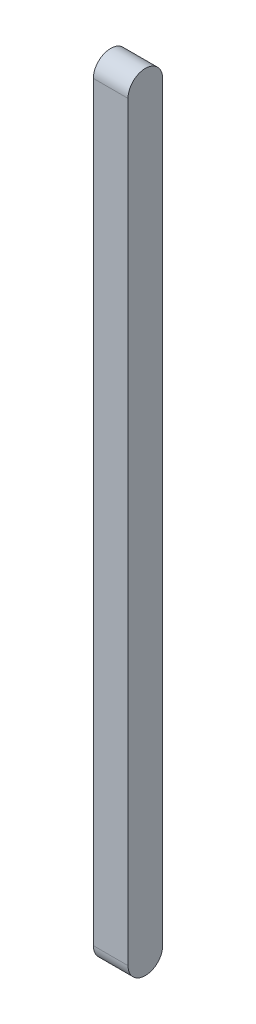
ISO-10303-21;
HEADER;
FILE_DESCRIPTION(('STEP AP214'),'2;1');
FILE_NAME('part.step','',(''),(''),'','','');
FILE_SCHEMA(('AUTOMOTIVE_DESIGN { 1 0 10303 214 1 1 1 1 }'));
ENDSEC;
DATA;
#1=APPLICATION_CONTEXT('core data for automotive mechanical design processes');
#2=APPLICATION_PROTOCOL_DEFINITION('international standard','automotive_design',2000,#1);
#3=PRODUCT_CONTEXT('',#1,'mechanical');
#4=PRODUCT('Part','Part','',(#3));
#5=PRODUCT_RELATED_PRODUCT_CATEGORY('part','',(#4));
#6=PRODUCT_DEFINITION_FORMATION('','',#4);
#7=PRODUCT_DEFINITION_CONTEXT('part definition',#1,'design');
#8=PRODUCT_DEFINITION('design','',#6,#7);
#9=PRODUCT_DEFINITION_SHAPE('','',#8);
#10=(LENGTH_UNIT() NAMED_UNIT(*) SI_UNIT(.MILLI.,.METRE.));
#11=(NAMED_UNIT(*) PLANE_ANGLE_UNIT() SI_UNIT($,.RADIAN.));
#12=(NAMED_UNIT(*) SI_UNIT($,.STERADIAN.) SOLID_ANGLE_UNIT());
#13=UNCERTAINTY_MEASURE_WITH_UNIT(LENGTH_MEASURE(1.E-05),#10,'distance_accuracy_value','');
#14=(GEOMETRIC_REPRESENTATION_CONTEXT(3) GLOBAL_UNCERTAINTY_ASSIGNED_CONTEXT((#13)) GLOBAL_UNIT_ASSIGNED_CONTEXT((#10,
#11,#12)) REPRESENTATION_CONTEXT('',''));
#15=CARTESIAN_POINT('',(0.,0.,0.));
#16=DIRECTION('',(0.,0.,1.));
#17=DIRECTION('',(1.,0.,0.));
#18=AXIS2_PLACEMENT_3D('',#15,#16,#17);
#19=CARTESIAN_POINT('',(15.,650.,-15.));
#20=DIRECTION('',(-1.,0.,0.));
#21=DIRECTION('',(0.,0.,1.));
#22=AXIS2_PLACEMENT_3D('',#19,#20,#21);
#23=PLANE('',#22);
#24=DIRECTION('',(0.,-1.,0.));
#25=VECTOR('',#24,1.);
#26=CARTESIAN_POINT('',(15.,650.,-15.));
#27=LINE('',#26,#25);
#28=CARTESIAN_POINT('',(15.,650.,-15.));
#29=VERTEX_POINT('',#28);
#30=CARTESIAN_POINT('',(15.,0.,-15.));
#31=VERTEX_POINT('',#30);
#32=EDGE_CURVE('E11',#29,#31,#27,.T.);
#33=ORIENTED_EDGE('',*,*,#32,.F.);
#34=CARTESIAN_POINT('',(15.,650.,0.));
#35=DIRECTION('',(-1.,0.,0.));
#36=DIRECTION('',(0.,0.,1.));
#37=AXIS2_PLACEMENT_3D('',#34,#35,#36);
#38=CIRCLE('',#37,15.);
#39=CARTESIAN_POINT('',(15.,650.,15.));
#40=VERTEX_POINT('',#39);
#41=EDGE_CURVE('E94',#40,#29,#38,.T.);
#42=ORIENTED_EDGE('',*,*,#41,.F.);
#43=DIRECTION('',(0.,-1.,0.));
#44=VECTOR('',#43,1.);
#45=CARTESIAN_POINT('',(15.,650.,15.));
#46=LINE('',#45,#44);
#47=CARTESIAN_POINT('',(15.,0.,15.));
#48=VERTEX_POINT('',#47);
#49=EDGE_CURVE('E54',#40,#48,#46,.T.);
#50=ORIENTED_EDGE('',*,*,#49,.T.);
#51=CARTESIAN_POINT('',(15.,0.,0.));
#52=DIRECTION('',(-1.,0.,0.));
#53=DIRECTION('',(0.,0.,1.));
#54=AXIS2_PLACEMENT_3D('',#51,#52,#53);
#55=CIRCLE('',#54,15.);
#56=EDGE_CURVE('E96',#31,#48,#55,.T.);
#57=ORIENTED_EDGE('',*,*,#56,.F.);
#58=EDGE_LOOP('',(#33,#42,#50,#57));
#59=FACE_BOUND('',#58,.T.);
#60=ADVANCED_FACE('F39',(#59),#23,.F.);
#61=CARTESIAN_POINT('',(-15.,650.,-15.));
#62=DIRECTION('',(0.,0.,1.));
#63=DIRECTION('',(1.,0.,0.));
#64=AXIS2_PLACEMENT_3D('',#61,#62,#63);
#65=PLANE('',#64);
#66=DIRECTION('',(-1.,0.,0.));
#67=VECTOR('',#66,1.);
#68=CARTESIAN_POINT('',(-15.,0.,-15.));
#69=LINE('',#68,#67);
#70=CARTESIAN_POINT('',(-15.,0.,-15.));
#71=VERTEX_POINT('',#70);
#72=EDGE_CURVE('E100',#31,#71,#69,.T.);
#73=ORIENTED_EDGE('',*,*,#72,.T.);
#74=DIRECTION('',(0.,-1.,0.));
#75=VECTOR('',#74,1.);
#76=CARTESIAN_POINT('',(-15.,650.,-15.));
#77=LINE('',#76,#75);
#78=CARTESIAN_POINT('',(-15.,650.,-15.));
#79=VERTEX_POINT('',#78);
#80=EDGE_CURVE('E47',#79,#71,#77,.T.);
#81=ORIENTED_EDGE('',*,*,#80,.F.);
#82=DIRECTION('',(-1.,0.,0.));
#83=VECTOR('',#82,1.);
#84=CARTESIAN_POINT('',(-15.,650.,-15.));
#85=LINE('',#84,#83);
#86=EDGE_CURVE('E81',#29,#79,#85,.T.);
#87=ORIENTED_EDGE('',*,*,#86,.F.);
#88=ORIENTED_EDGE('',*,*,#32,.T.);
#89=EDGE_LOOP('',(#73,#81,#87,#88));
#90=FACE_BOUND('',#89,.T.);
#91=ADVANCED_FACE('F108',(#90),#65,.F.);
#92=CARTESIAN_POINT('',(-15.,650.,-15.));
#93=DIRECTION('',(1.,0.,0.));
#94=DIRECTION('',(0.,0.,-1.));
#95=AXIS2_PLACEMENT_3D('',#92,#93,#94);
#96=PLANE('',#95);
#97=DIRECTION('',(0.,-1.,0.));
#98=VECTOR('',#97,1.);
#99=CARTESIAN_POINT('',(-15.,650.,15.));
#100=LINE('',#99,#98);
#101=CARTESIAN_POINT('',(-15.,650.,15.));
#102=VERTEX_POINT('',#101);
#103=CARTESIAN_POINT('',(-15.,0.,15.));
#104=VERTEX_POINT('',#103);
#105=EDGE_CURVE('E76',#102,#104,#100,.T.);
#106=ORIENTED_EDGE('',*,*,#105,.F.);
#107=CARTESIAN_POINT('',(-15.,650.,0.));
#108=DIRECTION('',(-1.,0.,0.));
#109=DIRECTION('',(0.,0.,1.));
#110=AXIS2_PLACEMENT_3D('',#107,#108,#109);
#111=CIRCLE('',#110,15.);
#112=EDGE_CURVE('E88',#102,#79,#111,.T.);
#113=ORIENTED_EDGE('',*,*,#112,.T.);
#114=ORIENTED_EDGE('',*,*,#80,.T.);
#115=CARTESIAN_POINT('',(-15.,0.,0.));
#116=DIRECTION('',(-1.,0.,0.));
#117=DIRECTION('',(0.,0.,1.));
#118=AXIS2_PLACEMENT_3D('',#115,#116,#117);
#119=CIRCLE('',#118,15.);
#120=EDGE_CURVE('E89',#71,#104,#119,.T.);
#121=ORIENTED_EDGE('',*,*,#120,.T.);
#122=EDGE_LOOP('',(#106,#113,#114,#121));
#123=FACE_BOUND('',#122,.T.);
#124=ADVANCED_FACE('F86',(#123),#96,.F.);
#125=CARTESIAN_POINT('',(-15.,650.,15.));
#126=DIRECTION('',(0.,0.,-1.));
#127=DIRECTION('',(-1.,0.,0.));
#128=AXIS2_PLACEMENT_3D('',#125,#126,#127);
#129=PLANE('',#128);
#130=DIRECTION('',(1.,0.,0.));
#131=VECTOR('',#130,1.);
#132=CARTESIAN_POINT('',(-15.,0.,15.));
#133=LINE('',#132,#131);
#134=EDGE_CURVE('E102',#104,#48,#133,.T.);
#135=ORIENTED_EDGE('',*,*,#134,.T.);
#136=ORIENTED_EDGE('',*,*,#49,.F.);
#137=DIRECTION('',(1.,0.,0.));
#138=VECTOR('',#137,1.);
#139=CARTESIAN_POINT('',(-15.,650.,15.));
#140=LINE('',#139,#138);
#141=EDGE_CURVE('E73',#102,#40,#140,.T.);
#142=ORIENTED_EDGE('',*,*,#141,.F.);
#143=ORIENTED_EDGE('',*,*,#105,.T.);
#144=EDGE_LOOP('',(#135,#136,#142,#143));
#145=FACE_BOUND('',#144,.T.);
#146=ADVANCED_FACE('F75',(#145),#129,.F.);
#147=CARTESIAN_POINT('',(15.,0.,0.));
#148=DIRECTION('',(-1.,0.,0.));
#149=DIRECTION('',(0.,0.,1.));
#150=AXIS2_PLACEMENT_3D('',#147,#148,#149);
#151=CYLINDRICAL_SURFACE('',#150,15.);
#152=ORIENTED_EDGE('',*,*,#72,.F.);
#153=ORIENTED_EDGE('',*,*,#56,.T.);
#154=ORIENTED_EDGE('',*,*,#134,.F.);
#155=ORIENTED_EDGE('',*,*,#120,.F.);
#156=EDGE_LOOP('',(#152,#153,#154,#155));
#157=FACE_BOUND('',#156,.T.);
#158=ADVANCED_FACE('F112',(#157),#151,.T.);
#159=CARTESIAN_POINT('',(15.,650.,0.));
#160=DIRECTION('',(-1.,0.,0.));
#161=DIRECTION('',(0.,0.,1.));
#162=AXIS2_PLACEMENT_3D('',#159,#160,#161);
#163=CYLINDRICAL_SURFACE('',#162,15.);
#164=ORIENTED_EDGE('',*,*,#41,.T.);
#165=ORIENTED_EDGE('',*,*,#86,.T.);
#166=ORIENTED_EDGE('',*,*,#112,.F.);
#167=ORIENTED_EDGE('',*,*,#141,.T.);
#168=EDGE_LOOP('',(#164,#165,#166,#167));
#169=FACE_BOUND('',#168,.T.);
#170=ADVANCED_FACE('F93',(#169),#163,.T.);
#171=CLOSED_SHELL('',(#60,#91,#124,#146,#158,#170));
#172=MANIFOLD_SOLID_BREP('B2',#171);
#173=ADVANCED_BREP_SHAPE_REPRESENTATION('',(#18,#172),#14);
#174=SHAPE_DEFINITION_REPRESENTATION(#9,#173);
ENDSEC;
END-ISO-10303-21;
